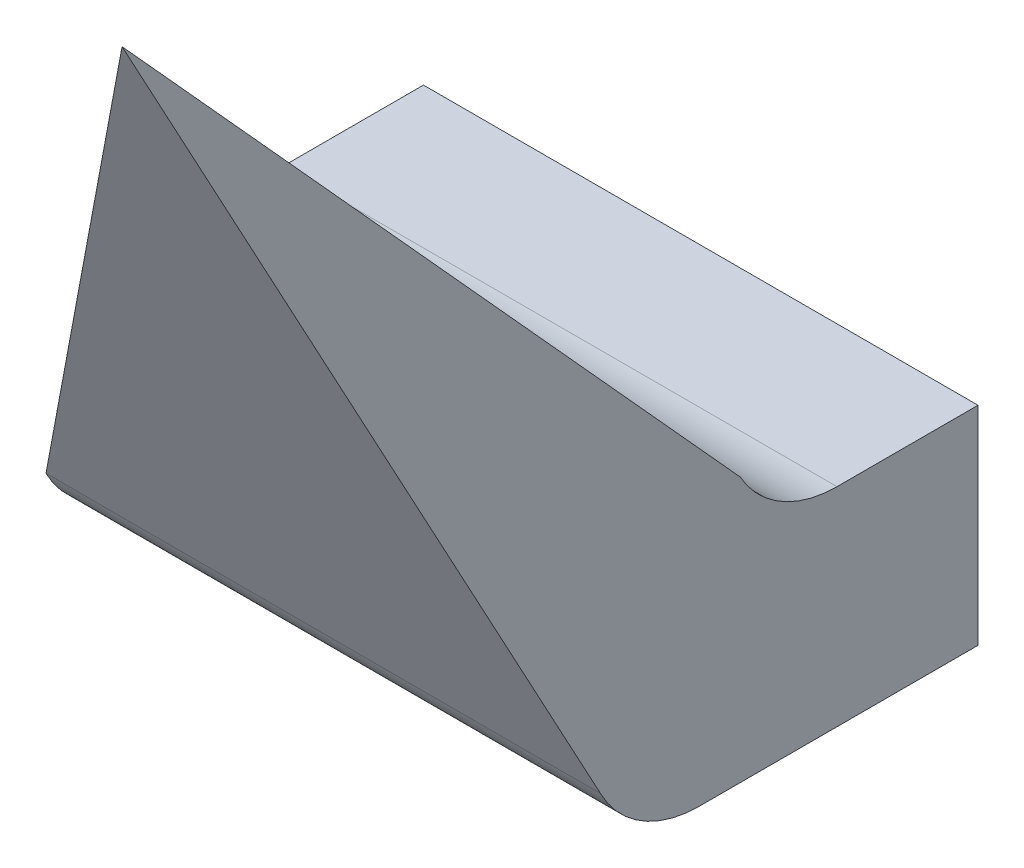
ISO-10303-21;
HEADER;
FILE_DESCRIPTION(('STEP AP214'),'2;1');
FILE_NAME('part.step','',(''),(''),'','','');
FILE_SCHEMA(('AUTOMOTIVE_DESIGN { 1 0 10303 214 1 1 1 1 }'));
ENDSEC;
DATA;
#1=APPLICATION_CONTEXT('core data for automotive mechanical design processes');
#2=APPLICATION_PROTOCOL_DEFINITION('international standard','automotive_design',2000,#1);
#3=PRODUCT_CONTEXT('',#1,'mechanical');
#4=PRODUCT('Part','Part','',(#3));
#5=PRODUCT_RELATED_PRODUCT_CATEGORY('part','',(#4));
#6=PRODUCT_DEFINITION_FORMATION('','',#4);
#7=PRODUCT_DEFINITION_CONTEXT('part definition',#1,'design');
#8=PRODUCT_DEFINITION('design','',#6,#7);
#9=PRODUCT_DEFINITION_SHAPE('','',#8);
#10=(LENGTH_UNIT() NAMED_UNIT(*) SI_UNIT(.MILLI.,.METRE.));
#11=(NAMED_UNIT(*) PLANE_ANGLE_UNIT() SI_UNIT($,.RADIAN.));
#12=(NAMED_UNIT(*) SI_UNIT($,.STERADIAN.) SOLID_ANGLE_UNIT());
#13=UNCERTAINTY_MEASURE_WITH_UNIT(LENGTH_MEASURE(1.E-05),#10,'distance_accuracy_value','');
#14=(GEOMETRIC_REPRESENTATION_CONTEXT(3) GLOBAL_UNCERTAINTY_ASSIGNED_CONTEXT((#13)) GLOBAL_UNIT_ASSIGNED_CONTEXT((#10,
#11,#12)) REPRESENTATION_CONTEXT('',''));
#15=CARTESIAN_POINT('',(0.,0.,0.));
#16=DIRECTION('',(0.,0.,1.));
#17=DIRECTION('',(1.,0.,0.));
#18=AXIS2_PLACEMENT_3D('',#15,#16,#17);
#19=CARTESIAN_POINT('',(-73.03907229268,21.89380350451,21.814122866963));
#20=DIRECTION('',(0.,0.455111059789055,-0.890434682196108));
#21=DIRECTION('',(0.,0.890434682196108,0.455111059789055));
#22=AXIS2_PLACEMENT_3D('',#19,#20,#21);
#23=PLANE('',#22);
#24=DIRECTION('',(-1.,0.,0.));
#25=VECTOR('',#24,1.);
#26=CARTESIAN_POINT('',(-73.03907229268,21.8938035045101,21.8141228669628));
#27=LINE('',#26,#25);
#28=CARTESIAN_POINT('',(-73.03907229268,21.8938035045099,21.8141228669628));
#29=VERTEX_POINT('',#28);
#30=CARTESIAN_POINT('',(-73.43907229268,21.8938035045099,21.8141228669628));
#31=VERTEX_POINT('',#30);
#32=EDGE_CURVE('E83',#29,#31,#27,.T.);
#33=ORIENTED_EDGE('',*,*,#32,.F.);
#34=DIRECTION('',(0.,-0.890434682195817,-0.455111059789624));
#35=VECTOR('',#34,1.);
#36=CARTESIAN_POINT('',(-73.03907229268,22.256621274076,21.999563060297));
#37=LINE('',#36,#35);
#38=CARTESIAN_POINT('',(-73.23907229268,22.3329201022555,21.959256338043));
#39=VERTEX_POINT('',#38);
#40=EDGE_CURVE('E47',#39,#29,#37,.T.);
#41=ORIENTED_EDGE('',*,*,#40,.F.);
#42=DIRECTION('',(0.,-0.890434682195817,-0.455111059789624));
#43=VECTOR('',#42,1.);
#44=CARTESIAN_POINT('',(-73.43907229268,22.256621274076,21.999563060297));
#45=LINE('',#44,#43);
#46=EDGE_CURVE('E97',#39,#31,#45,.T.);
#47=ORIENTED_EDGE('',*,*,#46,.T.);
#48=EDGE_LOOP('',(#33,#41,#47));
#49=FACE_BOUND('',#48,.T.);
#50=ADVANCED_FACE('F17',(#49),#23,.F.);
#51=CARTESIAN_POINT('',(-73.03907229268,21.930212389293,21.742888092387));
#52=DIRECTION('',(-1.,0.,0.));
#53=DIRECTION('',(0.,0.,1.));
#54=AXIS2_PLACEMENT_3D('',#51,#52,#53);
#55=CYLINDRICAL_SURFACE('',#54,0.08);
#56=CARTESIAN_POINT('',(-73.03907229268,21.930212389293,21.742888092387));
#57=DIRECTION('',(-1.,0.,0.));
#58=DIRECTION('',(0.,0.,1.));
#59=AXIS2_PLACEMENT_3D('',#56,#57,#58);
#60=CIRCLE('',#59,0.08);
#61=CARTESIAN_POINT('',(-73.03907229268,21.850212389293,21.742888092387));
#62=VERTEX_POINT('',#61);
#63=EDGE_CURVE('E20',#29,#62,#60,.F.);
#64=ORIENTED_EDGE('',*,*,#63,.F.);
#65=ORIENTED_EDGE('',*,*,#32,.T.);
#66=CARTESIAN_POINT('',(-73.43907229268,21.930212389293,21.742888092387));
#67=DIRECTION('',(-1.,0.,0.));
#68=DIRECTION('',(0.,0.,1.));
#69=AXIS2_PLACEMENT_3D('',#66,#67,#68);
#70=CIRCLE('',#69,0.08);
#71=CARTESIAN_POINT('',(-73.43907229268,21.850212389293,21.742888092387));
#72=VERTEX_POINT('',#71);
#73=EDGE_CURVE('E90',#31,#72,#70,.F.);
#74=ORIENTED_EDGE('',*,*,#73,.T.);
#75=DIRECTION('',(1.,0.,0.));
#76=VECTOR('',#75,1.);
#77=CARTESIAN_POINT('',(-73.03907229268,21.850212389293,21.742888092387));
#78=LINE('',#77,#76);
#79=EDGE_CURVE('E76',#72,#62,#78,.T.);
#80=ORIENTED_EDGE('',*,*,#79,.T.);
#81=EDGE_LOOP('',(#64,#65,#74,#80));
#82=FACE_BOUND('',#81,.T.);
#83=ADVANCED_FACE('F96',(#82),#55,.T.);
#84=CARTESIAN_POINT('',(-73.03907229268,21.850212389293,21.54184296363));
#85=DIRECTION('',(0.,1.,0.));
#86=DIRECTION('',(0.,0.,1.));
#87=AXIS2_PLACEMENT_3D('',#84,#85,#86);
#88=PLANE('',#87);
#89=DIRECTION('',(1.,0.,0.));
#90=VECTOR('',#89,1.);
#91=CARTESIAN_POINT('',(-73.03907229268,21.850212389293,21.54184296363));
#92=LINE('',#91,#90);
#93=CARTESIAN_POINT('',(-73.43907229268,21.850212389293,21.54184296363));
#94=VERTEX_POINT('',#93);
#95=CARTESIAN_POINT('',(-73.03907229268,21.850212389293,21.54184296363));
#96=VERTEX_POINT('',#95);
#97=EDGE_CURVE('E82',#94,#96,#92,.T.);
#98=ORIENTED_EDGE('',*,*,#97,.T.);
#99=DIRECTION('',(0.,0.,-1.));
#100=VECTOR('',#99,1.);
#101=CARTESIAN_POINT('',(-73.03907229268,21.850212389293,21.988795802143));
#102=LINE('',#101,#100);
#103=EDGE_CURVE('E57',#62,#96,#102,.T.);
#104=ORIENTED_EDGE('',*,*,#103,.F.);
#105=ORIENTED_EDGE('',*,*,#79,.F.);
#106=DIRECTION('',(0.,0.,-1.));
#107=VECTOR('',#106,1.);
#108=CARTESIAN_POINT('',(-73.43907229268,21.850212389293,21.988795802143));
#109=LINE('',#108,#107);
#110=EDGE_CURVE('E79',#72,#94,#109,.T.);
#111=ORIENTED_EDGE('',*,*,#110,.T.);
#112=EDGE_LOOP('',(#98,#104,#105,#111));
#113=FACE_BOUND('',#112,.T.);
#114=ADVANCED_FACE('F78',(#113),#88,.F.);
#115=CARTESIAN_POINT('',(-73.03907229268,22.000212389293,21.54184296363));
#116=DIRECTION('',(0.,0.,1.));
#117=DIRECTION('',(1.,0.,0.));
#118=AXIS2_PLACEMENT_3D('',#115,#116,#117);
#119=PLANE('',#118);
#120=DIRECTION('',(1.,0.,0.));
#121=VECTOR('',#120,1.);
#122=CARTESIAN_POINT('',(-73.03907229268,22.000212389293,21.54184296363));
#123=LINE('',#122,#121);
#124=CARTESIAN_POINT('',(-73.43907229268,22.000212389293,21.54184296363));
#125=VERTEX_POINT('',#124);
#126=CARTESIAN_POINT('',(-73.03907229268,22.000212389293,21.54184296363));
#127=VERTEX_POINT('',#126);
#128=EDGE_CURVE('E123',#125,#127,#123,.T.);
#129=ORIENTED_EDGE('',*,*,#128,.T.);
#130=DIRECTION('',(0.,1.,0.));
#131=VECTOR('',#130,1.);
#132=CARTESIAN_POINT('',(-73.03907229268,22.370212389293,21.54184296363));
#133=LINE('',#132,#131);
#134=EDGE_CURVE('E104',#96,#127,#133,.T.);
#135=ORIENTED_EDGE('',*,*,#134,.F.);
#136=ORIENTED_EDGE('',*,*,#97,.F.);
#137=DIRECTION('',(0.,1.,0.));
#138=VECTOR('',#137,1.);
#139=CARTESIAN_POINT('',(-73.43907229268,22.370212389293,21.54184296363));
#140=LINE('',#139,#138);
#141=EDGE_CURVE('E94',#94,#125,#140,.T.);
#142=ORIENTED_EDGE('',*,*,#141,.T.);
#143=EDGE_LOOP('',(#129,#135,#136,#142));
#144=FACE_BOUND('',#143,.T.);
#145=ADVANCED_FACE('F138',(#144),#119,.F.);
#146=CARTESIAN_POINT('',(-73.03907229268,22.000212389293,21.643581579434));
#147=DIRECTION('',(0.,-1.,0.));
#148=DIRECTION('',(0.,0.,-1.));
#149=AXIS2_PLACEMENT_3D('',#146,#147,#148);
#150=PLANE('',#149);
#151=DIRECTION('',(-1.,0.,0.));
#152=VECTOR('',#151,1.);
#153=CARTESIAN_POINT('',(-73.03907229268,22.000212389293,21.643581579434));
#154=LINE('',#153,#152);
#155=CARTESIAN_POINT('',(-73.43907229268,22.000212389293,21.643581579434));
#156=VERTEX_POINT('',#155);
#157=CARTESIAN_POINT('',(-73.03907229268,22.000212389293,21.643581579434));
#158=VERTEX_POINT('',#157);
#159=EDGE_CURVE('E119',#156,#158,#154,.F.);
#160=ORIENTED_EDGE('',*,*,#159,.T.);
#161=DIRECTION('',(0.,0.,-1.));
#162=VECTOR('',#161,1.);
#163=CARTESIAN_POINT('',(-73.03907229268,22.000212389293,21.988795802143));
#164=LINE('',#163,#162);
#165=EDGE_CURVE('E103',#127,#158,#164,.F.);
#166=ORIENTED_EDGE('',*,*,#165,.F.);
#167=ORIENTED_EDGE('',*,*,#128,.F.);
#168=DIRECTION('',(0.,0.,-1.));
#169=VECTOR('',#168,1.);
#170=CARTESIAN_POINT('',(-73.43907229268,22.000212389293,21.988795802143));
#171=LINE('',#170,#169);
#172=EDGE_CURVE('E129',#125,#156,#171,.F.);
#173=ORIENTED_EDGE('',*,*,#172,.T.);
#174=EDGE_LOOP('',(#160,#166,#167,#173));
#175=FACE_BOUND('',#174,.T.);
#176=ADVANCED_FACE('F151',(#175),#150,.F.);
#177=CARTESIAN_POINT('',(-73.03907229268,22.080212389293,21.643581579434));
#178=DIRECTION('',(-1.,0.,0.));
#179=DIRECTION('',(0.,0.,1.));
#180=AXIS2_PLACEMENT_3D('',#177,#178,#179);
#181=CYLINDRICAL_SURFACE('',#180,0.08);
#182=DIRECTION('',(1.,0.,0.));
#183=VECTOR('',#182,1.);
#184=CARTESIAN_POINT('',(-73.03907229268,22.0412058481508,21.7134277657873));
#185=LINE('',#184,#183);
#186=CARTESIAN_POINT('',(-73.43907229268,22.0412058481509,21.7134277657873));
#187=VERTEX_POINT('',#186);
#188=CARTESIAN_POINT('',(-73.03907229268,22.0412058481509,21.7134277657873));
#189=VERTEX_POINT('',#188);
#190=EDGE_CURVE('E161',#187,#189,#185,.T.);
#191=ORIENTED_EDGE('',*,*,#190,.T.);
#192=CARTESIAN_POINT('',(-73.03907229268,22.080212389293,21.643581579434));
#193=DIRECTION('',(-1.,0.,0.));
#194=DIRECTION('',(0.,0.,1.));
#195=AXIS2_PLACEMENT_3D('',#192,#193,#194);
#196=CIRCLE('',#195,0.08);
#197=EDGE_CURVE('E35',#158,#189,#196,.T.);
#198=ORIENTED_EDGE('',*,*,#197,.F.);
#199=ORIENTED_EDGE('',*,*,#159,.F.);
#200=CARTESIAN_POINT('',(-73.43907229268,22.080212389293,21.643581579434));
#201=DIRECTION('',(-1.,0.,0.));
#202=DIRECTION('',(0.,0.,1.));
#203=AXIS2_PLACEMENT_3D('',#200,#201,#202);
#204=CIRCLE('',#203,0.08);
#205=EDGE_CURVE('E101',#156,#187,#204,.T.);
#206=ORIENTED_EDGE('',*,*,#205,.T.);
#207=EDGE_LOOP('',(#191,#198,#199,#206));
#208=FACE_BOUND('',#207,.T.);
#209=ADVANCED_FACE('F142',(#208),#181,.F.);
#210=CARTESIAN_POINT('',(-73.03907229268,22.370212389293,21.988795802143));
#211=DIRECTION('',(1.,0.,0.));
#212=DIRECTION('',(0.,0.,-1.));
#213=AXIS2_PLACEMENT_3D('',#210,#211,#212);
#214=PLANE('',#213);
#215=DIRECTION('',(0.,-0.873077329419039,-0.487581764276022));
#216=VECTOR('',#215,1.);
#217=CARTESIAN_POINT('',(-73.03907229268,22.409218930435,21.918949615789));
#218=LINE('',#217,#216);
#219=EDGE_CURVE('E26',#189,#39,#218,.F.);
#220=ORIENTED_EDGE('',*,*,#219,.T.);
#221=ORIENTED_EDGE('',*,*,#40,.T.);
#222=ORIENTED_EDGE('',*,*,#63,.T.);
#223=ORIENTED_EDGE('',*,*,#103,.T.);
#224=ORIENTED_EDGE('',*,*,#134,.T.);
#225=ORIENTED_EDGE('',*,*,#165,.T.);
#226=ORIENTED_EDGE('',*,*,#197,.T.);
#227=EDGE_LOOP('',(#220,#221,#222,#223,#224,#225,#226));
#228=FACE_BOUND('',#227,.T.);
#229=ADVANCED_FACE('F140',(#228),#214,.T.);
#230=CARTESIAN_POINT('',(-73.43907229268,22.370212389293,21.988795802143));
#231=DIRECTION('',(1.,0.,0.));
#232=DIRECTION('',(0.,0.,-1.));
#233=AXIS2_PLACEMENT_3D('',#230,#231,#232);
#234=PLANE('',#233);
#235=DIRECTION('',(0.,-0.873077329419039,-0.487581764276022));
#236=VECTOR('',#235,1.);
#237=CARTESIAN_POINT('',(-73.43907229268,22.409218930435,21.918949615789));
#238=LINE('',#237,#236);
#239=EDGE_CURVE('E11',#39,#187,#238,.T.);
#240=ORIENTED_EDGE('',*,*,#239,.T.);
#241=ORIENTED_EDGE('',*,*,#205,.F.);
#242=ORIENTED_EDGE('',*,*,#172,.F.);
#243=ORIENTED_EDGE('',*,*,#141,.F.);
#244=ORIENTED_EDGE('',*,*,#110,.F.);
#245=ORIENTED_EDGE('',*,*,#73,.F.);
#246=ORIENTED_EDGE('',*,*,#46,.F.);
#247=EDGE_LOOP('',(#240,#241,#242,#243,#244,#245,#246));
#248=FACE_BOUND('',#247,.T.);
#249=ADVANCED_FACE('F88',(#248),#234,.F.);
#250=CARTESIAN_POINT('',(-73.03907229268,22.409218930435,21.918949615789));
#251=DIRECTION('',(0.,-0.487581764276022,0.873077329419039));
#252=DIRECTION('',(0.,-0.873077329419039,-0.487581764276022));
#253=AXIS2_PLACEMENT_3D('',#250,#251,#252);
#254=PLANE('',#253);
#255=ORIENTED_EDGE('',*,*,#219,.F.);
#256=ORIENTED_EDGE('',*,*,#190,.F.);
#257=ORIENTED_EDGE('',*,*,#239,.F.);
#258=EDGE_LOOP('',(#255,#256,#257));
#259=FACE_BOUND('',#258,.T.);
#260=ADVANCED_FACE('F149',(#259),#254,.F.);
#261=CLOSED_SHELL('',(#50,#83,#114,#145,#176,#209,#229,#249,#260));
#262=MANIFOLD_SOLID_BREP('B1',#261);
#263=ADVANCED_BREP_SHAPE_REPRESENTATION('',(#18,#262),#14);
#264=SHAPE_DEFINITION_REPRESENTATION(#9,#263);
ENDSEC;
END-ISO-10303-21;
